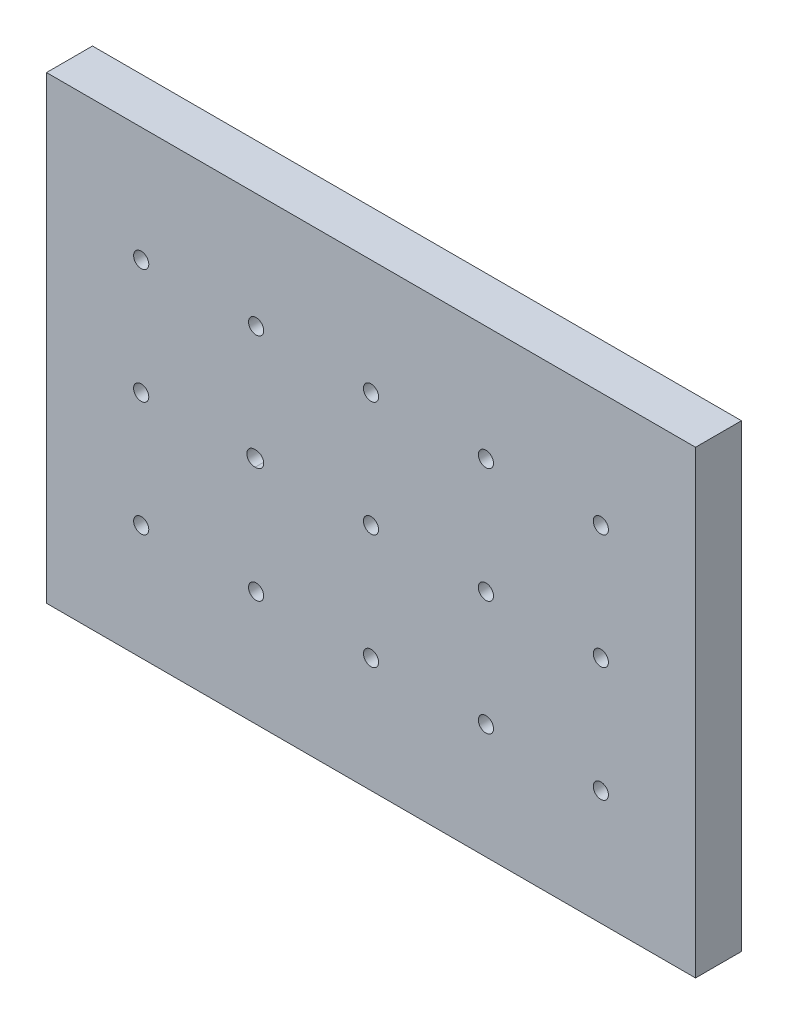
ISO-10303-21;
HEADER;
FILE_DESCRIPTION(('STEP AP214'),'2;1');
FILE_NAME('part.step','',(''),(''),'','','');
FILE_SCHEMA(('AUTOMOTIVE_DESIGN { 1 0 10303 214 1 1 1 1 }'));
ENDSEC;
DATA;
#1=APPLICATION_CONTEXT('core data for automotive mechanical design processes');
#2=APPLICATION_PROTOCOL_DEFINITION('international standard','automotive_design',2000,#1);
#3=PRODUCT_CONTEXT('',#1,'mechanical');
#4=PRODUCT('Part','Part','',(#3));
#5=PRODUCT_RELATED_PRODUCT_CATEGORY('part','',(#4));
#6=PRODUCT_DEFINITION_FORMATION('','',#4);
#7=PRODUCT_DEFINITION_CONTEXT('part definition',#1,'design');
#8=PRODUCT_DEFINITION('design','',#6,#7);
#9=PRODUCT_DEFINITION_SHAPE('','',#8);
#10=(LENGTH_UNIT() NAMED_UNIT(*) SI_UNIT(.MILLI.,.METRE.));
#11=(NAMED_UNIT(*) PLANE_ANGLE_UNIT() SI_UNIT($,.RADIAN.));
#12=(NAMED_UNIT(*) SI_UNIT($,.STERADIAN.) SOLID_ANGLE_UNIT());
#13=UNCERTAINTY_MEASURE_WITH_UNIT(LENGTH_MEASURE(1.E-05),#10,'distance_accuracy_value','');
#14=(GEOMETRIC_REPRESENTATION_CONTEXT(3) GLOBAL_UNCERTAINTY_ASSIGNED_CONTEXT((#13)) GLOBAL_UNIT_ASSIGNED_CONTEXT((#10,
#11,#12)) REPRESENTATION_CONTEXT('',''));
#15=CARTESIAN_POINT('',(0.,0.,0.));
#16=DIRECTION('',(0.,0.,1.));
#17=DIRECTION('',(1.,0.,0.));
#18=AXIS2_PLACEMENT_3D('',#15,#16,#17);
#19=CARTESIAN_POINT('',(0.,0.,10.));
#20=DIRECTION('',(-1.,0.,0.));
#21=DIRECTION('',(0.,0.,1.));
#22=AXIS2_PLACEMENT_3D('',#19,#20,#21);
#23=PLANE('',#22);
#24=DIRECTION('',(0.,1.,0.));
#25=VECTOR('',#24,1.);
#26=CARTESIAN_POINT('',(0.,0.,0.));
#27=LINE('',#26,#25);
#28=CARTESIAN_POINT('',(0.,0.,0.));
#29=VERTEX_POINT('',#28);
#30=CARTESIAN_POINT('',(0.,100.,0.));
#31=VERTEX_POINT('',#30);
#32=EDGE_CURVE('E184',#29,#31,#27,.T.);
#33=ORIENTED_EDGE('',*,*,#32,.T.);
#34=DIRECTION('',(0.,0.,-1.));
#35=VECTOR('',#34,1.);
#36=CARTESIAN_POINT('',(0.,100.,10.));
#37=LINE('',#36,#35);
#38=CARTESIAN_POINT('',(0.,100.,10.));
#39=VERTEX_POINT('',#38);
#40=EDGE_CURVE('E205',#39,#31,#37,.T.);
#41=ORIENTED_EDGE('',*,*,#40,.F.);
#42=DIRECTION('',(0.,1.,0.));
#43=VECTOR('',#42,1.);
#44=CARTESIAN_POINT('',(0.,0.,10.));
#45=LINE('',#44,#43);
#46=CARTESIAN_POINT('',(0.,0.,10.));
#47=VERTEX_POINT('',#46);
#48=EDGE_CURVE('E185',#47,#39,#45,.T.);
#49=ORIENTED_EDGE('',*,*,#48,.F.);
#50=DIRECTION('',(0.,0.,-1.));
#51=VECTOR('',#50,1.);
#52=CARTESIAN_POINT('',(0.,0.,10.));
#53=LINE('',#52,#51);
#54=EDGE_CURVE('E191',#47,#29,#53,.T.);
#55=ORIENTED_EDGE('',*,*,#54,.T.);
#56=EDGE_LOOP('',(#33,#41,#49,#55));
#57=FACE_BOUND('',#56,.T.);
#58=ADVANCED_FACE('F38',(#57),#23,.F.);
#59=CARTESIAN_POINT('',(0.,100.,10.));
#60=DIRECTION('',(0.,-1.,0.));
#61=DIRECTION('',(1.,0.,0.));
#62=AXIS2_PLACEMENT_3D('',#59,#60,#61);
#63=PLANE('',#62);
#64=DIRECTION('',(-1.,0.,0.));
#65=VECTOR('',#64,1.);
#66=CARTESIAN_POINT('',(0.,100.,0.));
#67=LINE('',#66,#65);
#68=CARTESIAN_POINT('',(-141.2,100.,0.));
#69=VERTEX_POINT('',#68);
#70=EDGE_CURVE('E194',#31,#69,#67,.T.);
#71=ORIENTED_EDGE('',*,*,#70,.T.);
#72=DIRECTION('',(0.,0.,-1.));
#73=VECTOR('',#72,1.);
#74=CARTESIAN_POINT('',(-141.2,100.,10.));
#75=LINE('',#74,#73);
#76=CARTESIAN_POINT('',(-141.2,100.,10.));
#77=VERTEX_POINT('',#76);
#78=EDGE_CURVE('E202',#77,#69,#75,.T.);
#79=ORIENTED_EDGE('',*,*,#78,.F.);
#80=DIRECTION('',(-1.,0.,0.));
#81=VECTOR('',#80,1.);
#82=CARTESIAN_POINT('',(0.,100.,10.));
#83=LINE('',#82,#81);
#84=EDGE_CURVE('E90',#39,#77,#83,.T.);
#85=ORIENTED_EDGE('',*,*,#84,.F.);
#86=ORIENTED_EDGE('',*,*,#40,.T.);
#87=EDGE_LOOP('',(#71,#79,#85,#86));
#88=FACE_BOUND('',#87,.T.);
#89=ADVANCED_FACE('F207',(#88),#63,.F.);
#90=CARTESIAN_POINT('',(-141.2,0.,10.));
#91=DIRECTION('',(1.,0.,0.));
#92=DIRECTION('',(0.,0.,-1.));
#93=AXIS2_PLACEMENT_3D('',#90,#91,#92);
#94=PLANE('',#93);
#95=DIRECTION('',(0.,-1.,0.));
#96=VECTOR('',#95,1.);
#97=CARTESIAN_POINT('',(-141.2,0.,0.));
#98=LINE('',#97,#96);
#99=CARTESIAN_POINT('',(-141.2,0.,0.));
#100=VERTEX_POINT('',#99);
#101=EDGE_CURVE('E196',#69,#100,#98,.T.);
#102=ORIENTED_EDGE('',*,*,#101,.T.);
#103=DIRECTION('',(0.,0.,-1.));
#104=VECTOR('',#103,1.);
#105=CARTESIAN_POINT('',(-141.2,0.,10.));
#106=LINE('',#105,#104);
#107=CARTESIAN_POINT('',(-141.2,0.,10.));
#108=VERTEX_POINT('',#107);
#109=EDGE_CURVE('E200',#108,#100,#106,.T.);
#110=ORIENTED_EDGE('',*,*,#109,.F.);
#111=DIRECTION('',(0.,-1.,0.));
#112=VECTOR('',#111,1.);
#113=CARTESIAN_POINT('',(-141.2,0.,10.));
#114=LINE('',#113,#112);
#115=EDGE_CURVE('E188',#77,#108,#114,.T.);
#116=ORIENTED_EDGE('',*,*,#115,.F.);
#117=ORIENTED_EDGE('',*,*,#78,.T.);
#118=EDGE_LOOP('',(#102,#110,#116,#117));
#119=FACE_BOUND('',#118,.T.);
#120=ADVANCED_FACE('F215',(#119),#94,.F.);
#121=CARTESIAN_POINT('',(0.,0.,10.));
#122=DIRECTION('',(0.,1.,0.));
#123=DIRECTION('',(-1.,0.,0.));
#124=AXIS2_PLACEMENT_3D('',#121,#122,#123);
#125=PLANE('',#124);
#126=DIRECTION('',(1.,0.,0.));
#127=VECTOR('',#126,1.);
#128=CARTESIAN_POINT('',(0.,0.,0.));
#129=LINE('',#128,#127);
#130=EDGE_CURVE('E82',#100,#29,#129,.T.);
#131=ORIENTED_EDGE('',*,*,#130,.T.);
#132=ORIENTED_EDGE('',*,*,#54,.F.);
#133=DIRECTION('',(1.,0.,0.));
#134=VECTOR('',#133,1.);
#135=CARTESIAN_POINT('',(0.,0.,10.));
#136=LINE('',#135,#134);
#137=EDGE_CURVE('E61',#108,#47,#136,.T.);
#138=ORIENTED_EDGE('',*,*,#137,.F.);
#139=ORIENTED_EDGE('',*,*,#109,.T.);
#140=EDGE_LOOP('',(#131,#132,#138,#139));
#141=FACE_BOUND('',#140,.T.);
#142=ADVANCED_FACE('F217',(#141),#125,.F.);
#143=CARTESIAN_POINT('',(0.,0.,10.));
#144=DIRECTION('',(0.,0.,1.));
#145=DIRECTION('',(1.,0.,0.));
#146=AXIS2_PLACEMENT_3D('',#143,#144,#145);
#147=PLANE('',#146);
#148=CARTESIAN_POINT('',(-70.6,50.,10.));
#149=DIRECTION('',(0.,0.,1.));
#150=DIRECTION('',(1.,0.,0.));
#151=AXIS2_PLACEMENT_3D('',#148,#149,#150);
#152=CIRCLE('',#151,1.65);
#153=CARTESIAN_POINT('',(-68.95,50.,10.));
#154=VERTEX_POINT('',#153);
#155=EDGE_CURVE('E516',#154,#154,#152,.T.);
#156=ORIENTED_EDGE('',*,*,#155,.F.);
#157=EDGE_LOOP('',(#156));
#158=FACE_BOUND('',#157,.T.);
#159=CARTESIAN_POINT('',(-95.6,50.,10.));
#160=DIRECTION('',(0.,0.,1.));
#161=DIRECTION('',(1.,0.,0.));
#162=AXIS2_PLACEMENT_3D('',#159,#160,#161);
#163=CIRCLE('',#162,1.65);
#164=CARTESIAN_POINT('',(-95.7864039854503,48.3605630374399,10.));
#165=VERTEX_POINT('',#164);
#166=CARTESIAN_POINT('',(-95.7864039854503,51.6394369625601,10.));
#167=VERTEX_POINT('',#166);
#168=EDGE_CURVE('E99',#165,#167,#163,.T.);
#169=ORIENTED_EDGE('',*,*,#168,.F.);
#170=CARTESIAN_POINT('',(-95.9728079709006,50.,10.));
#171=DIRECTION('',(0.,0.,1.));
#172=DIRECTION('',(1.,0.,0.));
#173=AXIS2_PLACEMENT_3D('',#170,#171,#172);
#174=CIRCLE('',#173,1.65);
#175=EDGE_CURVE('E113',#167,#165,#174,.T.);
#176=ORIENTED_EDGE('',*,*,#175,.F.);
#177=EDGE_LOOP('',(#169,#176));
#178=FACE_BOUND('',#177,.T.);
#179=CARTESIAN_POINT('',(-20.6,50.,10.));
#180=DIRECTION('',(0.,0.,1.));
#181=DIRECTION('',(1.,0.,0.));
#182=AXIS2_PLACEMENT_3D('',#179,#180,#181);
#183=CIRCLE('',#182,1.65);
#184=CARTESIAN_POINT('',(-18.95,50.,10.));
#185=VERTEX_POINT('',#184);
#186=EDGE_CURVE('E109',#185,#185,#183,.T.);
#187=ORIENTED_EDGE('',*,*,#186,.F.);
#188=EDGE_LOOP('',(#187));
#189=FACE_BOUND('',#188,.T.);
#190=CARTESIAN_POINT('',(-45.6,50.,10.));
#191=DIRECTION('',(0.,0.,1.));
#192=DIRECTION('',(1.,0.,0.));
#193=AXIS2_PLACEMENT_3D('',#190,#191,#192);
#194=CIRCLE('',#193,1.65);
#195=CARTESIAN_POINT('',(-43.95,50.,10.));
#196=VERTEX_POINT('',#195);
#197=EDGE_CURVE('E526',#196,#196,#194,.T.);
#198=ORIENTED_EDGE('',*,*,#197,.F.);
#199=EDGE_LOOP('',(#198));
#200=FACE_BOUND('',#199,.T.);
#201=CARTESIAN_POINT('',(-120.6,50.,10.));
#202=DIRECTION('',(0.,0.,1.));
#203=DIRECTION('',(1.,0.,0.));
#204=AXIS2_PLACEMENT_3D('',#201,#202,#203);
#205=CIRCLE('',#204,1.65);
#206=CARTESIAN_POINT('',(-118.95,50.,10.));
#207=VERTEX_POINT('',#206);
#208=EDGE_CURVE('E112',#207,#207,#205,.T.);
#209=ORIENTED_EDGE('',*,*,#208,.F.);
#210=EDGE_LOOP('',(#209));
#211=FACE_BOUND('',#210,.T.);
#212=CARTESIAN_POINT('',(-20.6,25.,10.));
#213=DIRECTION('',(0.,0.,1.));
#214=DIRECTION('',(1.,0.,0.));
#215=AXIS2_PLACEMENT_3D('',#212,#213,#214);
#216=CIRCLE('',#215,1.65);
#217=CARTESIAN_POINT('',(-18.95,25.,10.));
#218=VERTEX_POINT('',#217);
#219=EDGE_CURVE('E124',#218,#218,#216,.T.);
#220=ORIENTED_EDGE('',*,*,#219,.F.);
#221=EDGE_LOOP('',(#220));
#222=FACE_BOUND('',#221,.T.);
#223=CARTESIAN_POINT('',(-45.6,25.,10.));
#224=DIRECTION('',(0.,0.,1.));
#225=DIRECTION('',(1.,0.,0.));
#226=AXIS2_PLACEMENT_3D('',#223,#224,#225);
#227=CIRCLE('',#226,1.65);
#228=CARTESIAN_POINT('',(-43.95,25.,10.));
#229=VERTEX_POINT('',#228);
#230=EDGE_CURVE('E130',#229,#229,#227,.T.);
#231=ORIENTED_EDGE('',*,*,#230,.F.);
#232=EDGE_LOOP('',(#231));
#233=FACE_BOUND('',#232,.T.);
#234=CARTESIAN_POINT('',(-70.6,25.,10.));
#235=DIRECTION('',(0.,0.,1.));
#236=DIRECTION('',(1.,0.,0.));
#237=AXIS2_PLACEMENT_3D('',#234,#235,#236);
#238=CIRCLE('',#237,1.65);
#239=CARTESIAN_POINT('',(-68.95,25.,10.));
#240=VERTEX_POINT('',#239);
#241=EDGE_CURVE('E136',#240,#240,#238,.T.);
#242=ORIENTED_EDGE('',*,*,#241,.F.);
#243=EDGE_LOOP('',(#242));
#244=FACE_BOUND('',#243,.T.);
#245=CARTESIAN_POINT('',(-95.6,25.,10.));
#246=DIRECTION('',(0.,0.,1.));
#247=DIRECTION('',(1.,0.,0.));
#248=AXIS2_PLACEMENT_3D('',#245,#246,#247);
#249=CIRCLE('',#248,1.65);
#250=CARTESIAN_POINT('',(-93.95,25.,10.));
#251=VERTEX_POINT('',#250);
#252=EDGE_CURVE('E142',#251,#251,#249,.T.);
#253=ORIENTED_EDGE('',*,*,#252,.F.);
#254=EDGE_LOOP('',(#253));
#255=FACE_BOUND('',#254,.T.);
#256=CARTESIAN_POINT('',(-120.6,25.,10.));
#257=DIRECTION('',(0.,0.,1.));
#258=DIRECTION('',(1.,0.,0.));
#259=AXIS2_PLACEMENT_3D('',#256,#257,#258);
#260=CIRCLE('',#259,1.65);
#261=CARTESIAN_POINT('',(-118.95,25.,10.));
#262=VERTEX_POINT('',#261);
#263=EDGE_CURVE('E148',#262,#262,#260,.T.);
#264=ORIENTED_EDGE('',*,*,#263,.F.);
#265=EDGE_LOOP('',(#264));
#266=FACE_BOUND('',#265,.T.);
#267=CARTESIAN_POINT('',(-20.6,75.,10.));
#268=DIRECTION('',(0.,0.,1.));
#269=DIRECTION('',(1.,0.,0.));
#270=AXIS2_PLACEMENT_3D('',#267,#268,#269);
#271=CIRCLE('',#270,1.65);
#272=CARTESIAN_POINT('',(-18.95,75.,10.));
#273=VERTEX_POINT('',#272);
#274=EDGE_CURVE('E154',#273,#273,#271,.T.);
#275=ORIENTED_EDGE('',*,*,#274,.F.);
#276=EDGE_LOOP('',(#275));
#277=FACE_BOUND('',#276,.T.);
#278=CARTESIAN_POINT('',(-45.6,75.,10.));
#279=DIRECTION('',(0.,0.,1.));
#280=DIRECTION('',(1.,0.,0.));
#281=AXIS2_PLACEMENT_3D('',#278,#279,#280);
#282=CIRCLE('',#281,1.65);
#283=CARTESIAN_POINT('',(-43.95,75.,10.));
#284=VERTEX_POINT('',#283);
#285=EDGE_CURVE('E160',#284,#284,#282,.T.);
#286=ORIENTED_EDGE('',*,*,#285,.F.);
#287=EDGE_LOOP('',(#286));
#288=FACE_BOUND('',#287,.T.);
#289=CARTESIAN_POINT('',(-70.6,75.,10.));
#290=DIRECTION('',(0.,0.,1.));
#291=DIRECTION('',(1.,0.,0.));
#292=AXIS2_PLACEMENT_3D('',#289,#290,#291);
#293=CIRCLE('',#292,1.65);
#294=CARTESIAN_POINT('',(-68.95,75.,10.));
#295=VERTEX_POINT('',#294);
#296=EDGE_CURVE('E166',#295,#295,#293,.T.);
#297=ORIENTED_EDGE('',*,*,#296,.F.);
#298=EDGE_LOOP('',(#297));
#299=FACE_BOUND('',#298,.T.);
#300=CARTESIAN_POINT('',(-95.6,75.,10.));
#301=DIRECTION('',(0.,0.,1.));
#302=DIRECTION('',(1.,0.,0.));
#303=AXIS2_PLACEMENT_3D('',#300,#301,#302);
#304=CIRCLE('',#303,1.65);
#305=CARTESIAN_POINT('',(-93.95,75.,10.));
#306=VERTEX_POINT('',#305);
#307=EDGE_CURVE('E172',#306,#306,#304,.T.);
#308=ORIENTED_EDGE('',*,*,#307,.F.);
#309=EDGE_LOOP('',(#308));
#310=FACE_BOUND('',#309,.T.);
#311=CARTESIAN_POINT('',(-120.6,75.,10.));
#312=DIRECTION('',(0.,0.,1.));
#313=DIRECTION('',(1.,0.,0.));
#314=AXIS2_PLACEMENT_3D('',#311,#312,#313);
#315=CIRCLE('',#314,1.65);
#316=CARTESIAN_POINT('',(-118.95,75.,10.));
#317=VERTEX_POINT('',#316);
#318=EDGE_CURVE('E178',#317,#317,#315,.T.);
#319=ORIENTED_EDGE('',*,*,#318,.F.);
#320=EDGE_LOOP('',(#319));
#321=FACE_BOUND('',#320,.T.);
#322=ORIENTED_EDGE('',*,*,#48,.T.);
#323=ORIENTED_EDGE('',*,*,#84,.T.);
#324=ORIENTED_EDGE('',*,*,#115,.T.);
#325=ORIENTED_EDGE('',*,*,#137,.T.);
#326=EDGE_LOOP('',(#322,#323,#324,#325));
#327=FACE_BOUND('',#326,.T.);
#328=ADVANCED_FACE('F218',(#158,#178,#189,#200,#211,#222,#233,#244,#255,#266,#277,#288,#299,
#310,#321,#327),#147,.T.);
#329=CARTESIAN_POINT('',(0.,0.,0.));
#330=DIRECTION('',(0.,0.,1.));
#331=DIRECTION('',(1.,0.,0.));
#332=AXIS2_PLACEMENT_3D('',#329,#330,#331);
#333=PLANE('',#332);
#334=CARTESIAN_POINT('',(-70.6,50.,0.));
#335=DIRECTION('',(0.,0.,1.));
#336=DIRECTION('',(1.,0.,0.));
#337=AXIS2_PLACEMENT_3D('',#334,#335,#336);
#338=CIRCLE('',#337,1.65);
#339=CARTESIAN_POINT('',(-68.95,50.,0.));
#340=VERTEX_POINT('',#339);
#341=EDGE_CURVE('E514',#340,#340,#338,.T.);
#342=ORIENTED_EDGE('',*,*,#341,.T.);
#343=EDGE_LOOP('',(#342));
#344=FACE_BOUND('',#343,.T.);
#345=CARTESIAN_POINT('',(-20.6,50.,0.));
#346=DIRECTION('',(0.,0.,1.));
#347=DIRECTION('',(1.,0.,0.));
#348=AXIS2_PLACEMENT_3D('',#345,#346,#347);
#349=CIRCLE('',#348,1.65);
#350=CARTESIAN_POINT('',(-18.95,50.,0.));
#351=VERTEX_POINT('',#350);
#352=EDGE_CURVE('E523',#351,#351,#349,.T.);
#353=ORIENTED_EDGE('',*,*,#352,.T.);
#354=EDGE_LOOP('',(#353));
#355=FACE_BOUND('',#354,.T.);
#356=CARTESIAN_POINT('',(-45.6,50.,0.));
#357=DIRECTION('',(0.,0.,1.));
#358=DIRECTION('',(1.,0.,0.));
#359=AXIS2_PLACEMENT_3D('',#356,#357,#358);
#360=CIRCLE('',#359,1.65);
#361=CARTESIAN_POINT('',(-43.95,50.,0.));
#362=VERTEX_POINT('',#361);
#363=EDGE_CURVE('E118',#362,#362,#360,.T.);
#364=ORIENTED_EDGE('',*,*,#363,.T.);
#365=EDGE_LOOP('',(#364));
#366=FACE_BOUND('',#365,.T.);
#367=CARTESIAN_POINT('',(-95.9728079709006,50.,0.));
#368=DIRECTION('',(0.,0.,1.));
#369=DIRECTION('',(1.,0.,0.));
#370=AXIS2_PLACEMENT_3D('',#367,#368,#369);
#371=CIRCLE('',#370,1.65);
#372=CARTESIAN_POINT('',(-95.7864039854503,51.6394369625601,0.));
#373=VERTEX_POINT('',#372);
#374=CARTESIAN_POINT('',(-95.7864039854503,48.3605630374399,0.));
#375=VERTEX_POINT('',#374);
#376=EDGE_CURVE('E108',#373,#375,#371,.T.);
#377=ORIENTED_EDGE('',*,*,#376,.T.);
#378=CARTESIAN_POINT('',(-95.6,50.,0.));
#379=DIRECTION('',(0.,0.,1.));
#380=DIRECTION('',(1.,0.,0.));
#381=AXIS2_PLACEMENT_3D('',#378,#379,#380);
#382=CIRCLE('',#381,1.65);
#383=EDGE_CURVE('E52',#375,#373,#382,.T.);
#384=ORIENTED_EDGE('',*,*,#383,.T.);
#385=EDGE_LOOP('',(#377,#384));
#386=FACE_BOUND('',#385,.T.);
#387=CARTESIAN_POINT('',(-120.6,50.,0.));
#388=DIRECTION('',(0.,0.,1.));
#389=DIRECTION('',(1.,0.,0.));
#390=AXIS2_PLACEMENT_3D('',#387,#388,#389);
#391=CIRCLE('',#390,1.65);
#392=CARTESIAN_POINT('',(-118.95,50.,0.));
#393=VERTEX_POINT('',#392);
#394=EDGE_CURVE('E116',#393,#393,#391,.T.);
#395=ORIENTED_EDGE('',*,*,#394,.T.);
#396=EDGE_LOOP('',(#395));
#397=FACE_BOUND('',#396,.T.);
#398=CARTESIAN_POINT('',(-20.6,25.,0.));
#399=DIRECTION('',(0.,0.,1.));
#400=DIRECTION('',(1.,0.,0.));
#401=AXIS2_PLACEMENT_3D('',#398,#399,#400);
#402=CIRCLE('',#401,1.65);
#403=CARTESIAN_POINT('',(-18.95,25.,0.));
#404=VERTEX_POINT('',#403);
#405=EDGE_CURVE('E127',#404,#404,#402,.T.);
#406=ORIENTED_EDGE('',*,*,#405,.T.);
#407=EDGE_LOOP('',(#406));
#408=FACE_BOUND('',#407,.T.);
#409=CARTESIAN_POINT('',(-45.6,25.,0.));
#410=DIRECTION('',(0.,0.,1.));
#411=DIRECTION('',(1.,0.,0.));
#412=AXIS2_PLACEMENT_3D('',#409,#410,#411);
#413=CIRCLE('',#412,1.65);
#414=CARTESIAN_POINT('',(-43.95,25.,0.));
#415=VERTEX_POINT('',#414);
#416=EDGE_CURVE('E133',#415,#415,#413,.T.);
#417=ORIENTED_EDGE('',*,*,#416,.T.);
#418=EDGE_LOOP('',(#417));
#419=FACE_BOUND('',#418,.T.);
#420=CARTESIAN_POINT('',(-70.6,25.,0.));
#421=DIRECTION('',(0.,0.,1.));
#422=DIRECTION('',(1.,0.,0.));
#423=AXIS2_PLACEMENT_3D('',#420,#421,#422);
#424=CIRCLE('',#423,1.65);
#425=CARTESIAN_POINT('',(-68.95,25.,0.));
#426=VERTEX_POINT('',#425);
#427=EDGE_CURVE('E139',#426,#426,#424,.T.);
#428=ORIENTED_EDGE('',*,*,#427,.T.);
#429=EDGE_LOOP('',(#428));
#430=FACE_BOUND('',#429,.T.);
#431=CARTESIAN_POINT('',(-95.6,25.,0.));
#432=DIRECTION('',(0.,0.,1.));
#433=DIRECTION('',(1.,0.,0.));
#434=AXIS2_PLACEMENT_3D('',#431,#432,#433);
#435=CIRCLE('',#434,1.65);
#436=CARTESIAN_POINT('',(-93.95,25.,0.));
#437=VERTEX_POINT('',#436);
#438=EDGE_CURVE('E145',#437,#437,#435,.T.);
#439=ORIENTED_EDGE('',*,*,#438,.T.);
#440=EDGE_LOOP('',(#439));
#441=FACE_BOUND('',#440,.T.);
#442=CARTESIAN_POINT('',(-120.6,25.,0.));
#443=DIRECTION('',(0.,0.,1.));
#444=DIRECTION('',(1.,0.,0.));
#445=AXIS2_PLACEMENT_3D('',#442,#443,#444);
#446=CIRCLE('',#445,1.65);
#447=CARTESIAN_POINT('',(-118.95,25.,0.));
#448=VERTEX_POINT('',#447);
#449=EDGE_CURVE('E151',#448,#448,#446,.T.);
#450=ORIENTED_EDGE('',*,*,#449,.T.);
#451=EDGE_LOOP('',(#450));
#452=FACE_BOUND('',#451,.T.);
#453=CARTESIAN_POINT('',(-20.6,75.,0.));
#454=DIRECTION('',(0.,0.,1.));
#455=DIRECTION('',(1.,0.,0.));
#456=AXIS2_PLACEMENT_3D('',#453,#454,#455);
#457=CIRCLE('',#456,1.65);
#458=CARTESIAN_POINT('',(-18.95,75.,0.));
#459=VERTEX_POINT('',#458);
#460=EDGE_CURVE('E157',#459,#459,#457,.T.);
#461=ORIENTED_EDGE('',*,*,#460,.T.);
#462=EDGE_LOOP('',(#461));
#463=FACE_BOUND('',#462,.T.);
#464=CARTESIAN_POINT('',(-45.6,75.,0.));
#465=DIRECTION('',(0.,0.,1.));
#466=DIRECTION('',(1.,0.,0.));
#467=AXIS2_PLACEMENT_3D('',#464,#465,#466);
#468=CIRCLE('',#467,1.65);
#469=CARTESIAN_POINT('',(-43.95,75.,0.));
#470=VERTEX_POINT('',#469);
#471=EDGE_CURVE('E163',#470,#470,#468,.T.);
#472=ORIENTED_EDGE('',*,*,#471,.T.);
#473=EDGE_LOOP('',(#472));
#474=FACE_BOUND('',#473,.T.);
#475=CARTESIAN_POINT('',(-70.6,75.,0.));
#476=DIRECTION('',(0.,0.,1.));
#477=DIRECTION('',(1.,0.,0.));
#478=AXIS2_PLACEMENT_3D('',#475,#476,#477);
#479=CIRCLE('',#478,1.65);
#480=CARTESIAN_POINT('',(-68.95,75.,0.));
#481=VERTEX_POINT('',#480);
#482=EDGE_CURVE('E169',#481,#481,#479,.T.);
#483=ORIENTED_EDGE('',*,*,#482,.T.);
#484=EDGE_LOOP('',(#483));
#485=FACE_BOUND('',#484,.T.);
#486=CARTESIAN_POINT('',(-95.6,75.,0.));
#487=DIRECTION('',(0.,0.,1.));
#488=DIRECTION('',(1.,0.,0.));
#489=AXIS2_PLACEMENT_3D('',#486,#487,#488);
#490=CIRCLE('',#489,1.65);
#491=CARTESIAN_POINT('',(-93.95,75.,0.));
#492=VERTEX_POINT('',#491);
#493=EDGE_CURVE('E175',#492,#492,#490,.T.);
#494=ORIENTED_EDGE('',*,*,#493,.T.);
#495=EDGE_LOOP('',(#494));
#496=FACE_BOUND('',#495,.T.);
#497=CARTESIAN_POINT('',(-120.6,75.,0.));
#498=DIRECTION('',(0.,0.,1.));
#499=DIRECTION('',(1.,0.,0.));
#500=AXIS2_PLACEMENT_3D('',#497,#498,#499);
#501=CIRCLE('',#500,1.65);
#502=CARTESIAN_POINT('',(-118.95,75.,0.));
#503=VERTEX_POINT('',#502);
#504=EDGE_CURVE('E181',#503,#503,#501,.T.);
#505=ORIENTED_EDGE('',*,*,#504,.T.);
#506=EDGE_LOOP('',(#505));
#507=FACE_BOUND('',#506,.T.);
#508=ORIENTED_EDGE('',*,*,#32,.F.);
#509=ORIENTED_EDGE('',*,*,#130,.F.);
#510=ORIENTED_EDGE('',*,*,#101,.F.);
#511=ORIENTED_EDGE('',*,*,#70,.F.);
#512=EDGE_LOOP('',(#508,#509,#510,#511));
#513=FACE_BOUND('',#512,.T.);
#514=ADVANCED_FACE('F106',(#344,#355,#366,#386,#397,#408,#419,#430,#441,#452,#463,#474,#485,
#496,#507,#513),#333,.F.);
#515=CARTESIAN_POINT('',(-120.6,75.,10.));
#516=DIRECTION('',(0.,0.,1.));
#517=DIRECTION('',(1.,0.,0.));
#518=AXIS2_PLACEMENT_3D('',#515,#516,#517);
#519=CYLINDRICAL_SURFACE('',#518,1.65);
#520=ORIENTED_EDGE('',*,*,#504,.F.);
#521=EDGE_LOOP('',(#520));
#522=FACE_BOUND('',#521,.T.);
#523=ORIENTED_EDGE('',*,*,#318,.T.);
#524=EDGE_LOOP('',(#523));
#525=FACE_BOUND('',#524,.T.);
#526=ADVANCED_FACE('F226',(#522,#525),#519,.F.);
#527=CARTESIAN_POINT('',(-95.6,75.,10.));
#528=DIRECTION('',(0.,0.,1.));
#529=DIRECTION('',(1.,0.,0.));
#530=AXIS2_PLACEMENT_3D('',#527,#528,#529);
#531=CYLINDRICAL_SURFACE('',#530,1.65);
#532=ORIENTED_EDGE('',*,*,#493,.F.);
#533=EDGE_LOOP('',(#532));
#534=FACE_BOUND('',#533,.T.);
#535=ORIENTED_EDGE('',*,*,#307,.T.);
#536=EDGE_LOOP('',(#535));
#537=FACE_BOUND('',#536,.T.);
#538=ADVANCED_FACE('F277',(#534,#537),#531,.F.);
#539=CARTESIAN_POINT('',(-70.6,75.,10.));
#540=DIRECTION('',(0.,0.,1.));
#541=DIRECTION('',(1.,0.,0.));
#542=AXIS2_PLACEMENT_3D('',#539,#540,#541);
#543=CYLINDRICAL_SURFACE('',#542,1.65);
#544=ORIENTED_EDGE('',*,*,#482,.F.);
#545=EDGE_LOOP('',(#544));
#546=FACE_BOUND('',#545,.T.);
#547=ORIENTED_EDGE('',*,*,#296,.T.);
#548=EDGE_LOOP('',(#547));
#549=FACE_BOUND('',#548,.T.);
#550=ADVANCED_FACE('F287',(#546,#549),#543,.F.);
#551=CARTESIAN_POINT('',(-45.6,75.,10.));
#552=DIRECTION('',(0.,0.,1.));
#553=DIRECTION('',(1.,0.,0.));
#554=AXIS2_PLACEMENT_3D('',#551,#552,#553);
#555=CYLINDRICAL_SURFACE('',#554,1.65);
#556=ORIENTED_EDGE('',*,*,#471,.F.);
#557=EDGE_LOOP('',(#556));
#558=FACE_BOUND('',#557,.T.);
#559=ORIENTED_EDGE('',*,*,#285,.T.);
#560=EDGE_LOOP('',(#559));
#561=FACE_BOUND('',#560,.T.);
#562=ADVANCED_FACE('F298',(#558,#561),#555,.F.);
#563=CARTESIAN_POINT('',(-20.6,75.,10.));
#564=DIRECTION('',(0.,0.,1.));
#565=DIRECTION('',(1.,0.,0.));
#566=AXIS2_PLACEMENT_3D('',#563,#564,#565);
#567=CYLINDRICAL_SURFACE('',#566,1.65);
#568=ORIENTED_EDGE('',*,*,#460,.F.);
#569=EDGE_LOOP('',(#568));
#570=FACE_BOUND('',#569,.T.);
#571=ORIENTED_EDGE('',*,*,#274,.T.);
#572=EDGE_LOOP('',(#571));
#573=FACE_BOUND('',#572,.T.);
#574=ADVANCED_FACE('F310',(#570,#573),#567,.F.);
#575=CARTESIAN_POINT('',(-120.6,25.,10.));
#576=DIRECTION('',(0.,0.,1.));
#577=DIRECTION('',(1.,0.,0.));
#578=AXIS2_PLACEMENT_3D('',#575,#576,#577);
#579=CYLINDRICAL_SURFACE('',#578,1.65);
#580=ORIENTED_EDGE('',*,*,#449,.F.);
#581=EDGE_LOOP('',(#580));
#582=FACE_BOUND('',#581,.T.);
#583=ORIENTED_EDGE('',*,*,#263,.T.);
#584=EDGE_LOOP('',(#583));
#585=FACE_BOUND('',#584,.T.);
#586=ADVANCED_FACE('F322',(#582,#585),#579,.F.);
#587=CARTESIAN_POINT('',(-95.6,25.,10.));
#588=DIRECTION('',(0.,0.,1.));
#589=DIRECTION('',(1.,0.,0.));
#590=AXIS2_PLACEMENT_3D('',#587,#588,#589);
#591=CYLINDRICAL_SURFACE('',#590,1.65);
#592=ORIENTED_EDGE('',*,*,#438,.F.);
#593=EDGE_LOOP('',(#592));
#594=FACE_BOUND('',#593,.T.);
#595=ORIENTED_EDGE('',*,*,#252,.T.);
#596=EDGE_LOOP('',(#595));
#597=FACE_BOUND('',#596,.T.);
#598=ADVANCED_FACE('F334',(#594,#597),#591,.F.);
#599=CARTESIAN_POINT('',(-70.6,25.,10.));
#600=DIRECTION('',(0.,0.,1.));
#601=DIRECTION('',(1.,0.,0.));
#602=AXIS2_PLACEMENT_3D('',#599,#600,#601);
#603=CYLINDRICAL_SURFACE('',#602,1.65);
#604=ORIENTED_EDGE('',*,*,#427,.F.);
#605=EDGE_LOOP('',(#604));
#606=FACE_BOUND('',#605,.T.);
#607=ORIENTED_EDGE('',*,*,#241,.T.);
#608=EDGE_LOOP('',(#607));
#609=FACE_BOUND('',#608,.T.);
#610=ADVANCED_FACE('F346',(#606,#609),#603,.F.);
#611=CARTESIAN_POINT('',(-45.6,25.,10.));
#612=DIRECTION('',(0.,0.,1.));
#613=DIRECTION('',(1.,0.,0.));
#614=AXIS2_PLACEMENT_3D('',#611,#612,#613);
#615=CYLINDRICAL_SURFACE('',#614,1.65);
#616=ORIENTED_EDGE('',*,*,#416,.F.);
#617=EDGE_LOOP('',(#616));
#618=FACE_BOUND('',#617,.T.);
#619=ORIENTED_EDGE('',*,*,#230,.T.);
#620=EDGE_LOOP('',(#619));
#621=FACE_BOUND('',#620,.T.);
#622=ADVANCED_FACE('F358',(#618,#621),#615,.F.);
#623=CARTESIAN_POINT('',(-20.6,25.,10.));
#624=DIRECTION('',(0.,0.,1.));
#625=DIRECTION('',(1.,0.,0.));
#626=AXIS2_PLACEMENT_3D('',#623,#624,#625);
#627=CYLINDRICAL_SURFACE('',#626,1.65);
#628=ORIENTED_EDGE('',*,*,#405,.F.);
#629=EDGE_LOOP('',(#628));
#630=FACE_BOUND('',#629,.T.);
#631=ORIENTED_EDGE('',*,*,#219,.T.);
#632=EDGE_LOOP('',(#631));
#633=FACE_BOUND('',#632,.T.);
#634=ADVANCED_FACE('F370',(#630,#633),#627,.F.);
#635=CARTESIAN_POINT('',(-120.6,50.,10.));
#636=DIRECTION('',(0.,0.,1.));
#637=DIRECTION('',(1.,0.,0.));
#638=AXIS2_PLACEMENT_3D('',#635,#636,#637);
#639=CYLINDRICAL_SURFACE('',#638,1.65);
#640=ORIENTED_EDGE('',*,*,#394,.F.);
#641=EDGE_LOOP('',(#640));
#642=FACE_BOUND('',#641,.T.);
#643=ORIENTED_EDGE('',*,*,#208,.T.);
#644=EDGE_LOOP('',(#643));
#645=FACE_BOUND('',#644,.T.);
#646=ADVANCED_FACE('F382',(#642,#645),#639,.F.);
#647=CARTESIAN_POINT('',(-95.9728079709006,50.,10.));
#648=DIRECTION('',(0.,0.,1.));
#649=DIRECTION('',(1.,0.,0.));
#650=AXIS2_PLACEMENT_3D('',#647,#648,#649);
#651=CYLINDRICAL_SURFACE('',#650,1.65);
#652=ORIENTED_EDGE('',*,*,#376,.F.);
#653=DIRECTION('',(0.,0.,1.));
#654=VECTOR('',#653,1.);
#655=CARTESIAN_POINT('',(-95.7864039854503,51.6394369625601,5.));
#656=LINE('',#655,#654);
#657=EDGE_CURVE('E11',#373,#167,#656,.T.);
#658=ORIENTED_EDGE('',*,*,#657,.T.);
#659=ORIENTED_EDGE('',*,*,#175,.T.);
#660=DIRECTION('',(0.,0.,1.));
#661=VECTOR('',#660,1.);
#662=CARTESIAN_POINT('',(-95.7864039854503,48.3605630374399,5.));
#663=LINE('',#662,#661);
#664=EDGE_CURVE('E45',#165,#375,#663,.F.);
#665=ORIENTED_EDGE('',*,*,#664,.T.);
#666=EDGE_LOOP('',(#652,#658,#659,#665));
#667=FACE_BOUND('',#666,.T.);
#668=ADVANCED_FACE('F111',(#667),#651,.F.);
#669=CARTESIAN_POINT('',(-45.6,50.,10.));
#670=DIRECTION('',(0.,0.,1.));
#671=DIRECTION('',(1.,0.,0.));
#672=AXIS2_PLACEMENT_3D('',#669,#670,#671);
#673=CYLINDRICAL_SURFACE('',#672,1.65);
#674=ORIENTED_EDGE('',*,*,#363,.F.);
#675=EDGE_LOOP('',(#674));
#676=FACE_BOUND('',#675,.T.);
#677=ORIENTED_EDGE('',*,*,#197,.T.);
#678=EDGE_LOOP('',(#677));
#679=FACE_BOUND('',#678,.T.);
#680=ADVANCED_FACE('F405',(#676,#679),#673,.F.);
#681=CARTESIAN_POINT('',(-20.6,50.,10.));
#682=DIRECTION('',(0.,0.,1.));
#683=DIRECTION('',(1.,0.,0.));
#684=AXIS2_PLACEMENT_3D('',#681,#682,#683);
#685=CYLINDRICAL_SURFACE('',#684,1.65);
#686=ORIENTED_EDGE('',*,*,#352,.F.);
#687=EDGE_LOOP('',(#686));
#688=FACE_BOUND('',#687,.T.);
#689=ORIENTED_EDGE('',*,*,#186,.T.);
#690=EDGE_LOOP('',(#689));
#691=FACE_BOUND('',#690,.T.);
#692=ADVANCED_FACE('F415',(#688,#691),#685,.F.);
#693=CARTESIAN_POINT('',(-95.6,50.,10.));
#694=DIRECTION('',(0.,0.,1.));
#695=DIRECTION('',(1.,0.,0.));
#696=AXIS2_PLACEMENT_3D('',#693,#694,#695);
#697=CYLINDRICAL_SURFACE('',#696,1.65);
#698=ORIENTED_EDGE('',*,*,#383,.F.);
#699=ORIENTED_EDGE('',*,*,#664,.F.);
#700=ORIENTED_EDGE('',*,*,#168,.T.);
#701=ORIENTED_EDGE('',*,*,#657,.F.);
#702=EDGE_LOOP('',(#698,#699,#700,#701));
#703=FACE_BOUND('',#702,.T.);
#704=ADVANCED_FACE('F97',(#703),#697,.F.);
#705=CARTESIAN_POINT('',(-70.6,50.,10.));
#706=DIRECTION('',(0.,0.,1.));
#707=DIRECTION('',(1.,0.,0.));
#708=AXIS2_PLACEMENT_3D('',#705,#706,#707);
#709=CYLINDRICAL_SURFACE('',#708,1.65);
#710=ORIENTED_EDGE('',*,*,#341,.F.);
#711=EDGE_LOOP('',(#710));
#712=FACE_BOUND('',#711,.T.);
#713=ORIENTED_EDGE('',*,*,#155,.T.);
#714=EDGE_LOOP('',(#713));
#715=FACE_BOUND('',#714,.T.);
#716=ADVANCED_FACE('F437',(#712,#715),#709,.F.);
#717=CLOSED_SHELL('',(#58,#89,#120,#142,#328,#514,#526,#538,#550,#562,#574,#586,#598,#610,#622,
#634,#646,#668,#680,#692,#704,#716));
#718=MANIFOLD_SOLID_BREP('B2',#717);
#719=ADVANCED_BREP_SHAPE_REPRESENTATION('',(#18,#718),#14);
#720=SHAPE_DEFINITION_REPRESENTATION(#9,#719);
ENDSEC;
END-ISO-10303-21;
